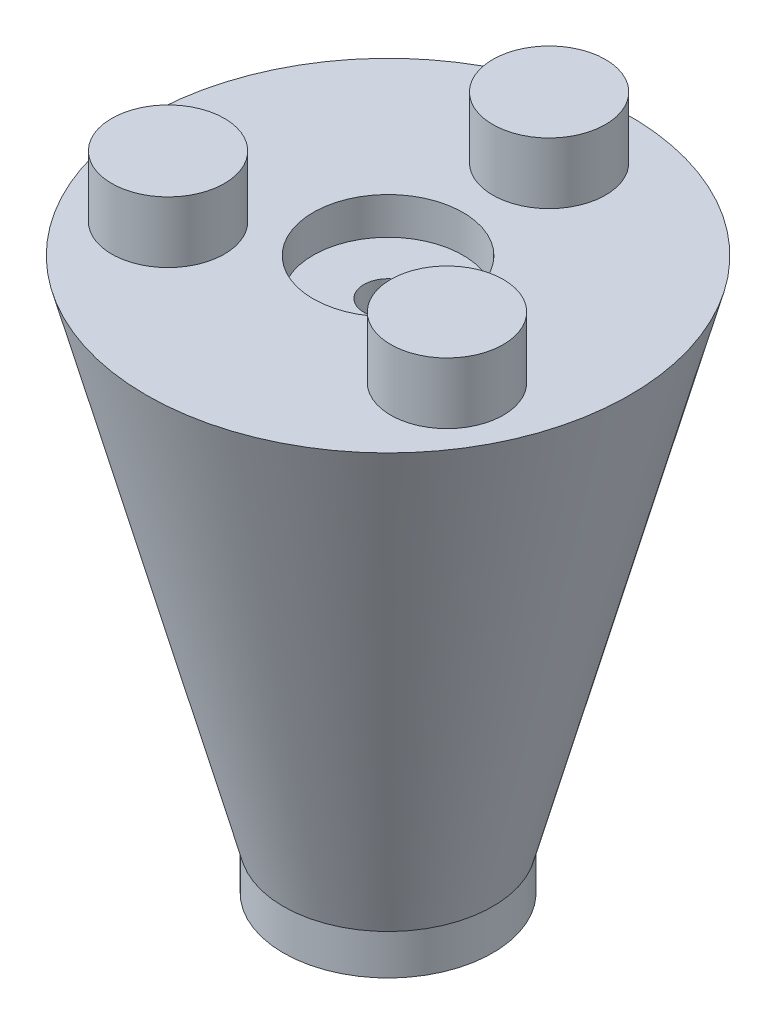
ISO-10303-21;
HEADER;
FILE_DESCRIPTION(('STEP AP214'),'2;1');
FILE_NAME('part.step','',(''),(''),'','','');
FILE_SCHEMA(('AUTOMOTIVE_DESIGN { 1 0 10303 214 1 1 1 1 }'));
ENDSEC;
DATA;
#1=APPLICATION_CONTEXT('core data for automotive mechanical design processes');
#2=APPLICATION_PROTOCOL_DEFINITION('international standard','automotive_design',2000,#1);
#3=PRODUCT_CONTEXT('',#1,'mechanical');
#4=PRODUCT('Part','Part','',(#3));
#5=PRODUCT_RELATED_PRODUCT_CATEGORY('part','',(#4));
#6=PRODUCT_DEFINITION_FORMATION('','',#4);
#7=PRODUCT_DEFINITION_CONTEXT('part definition',#1,'design');
#8=PRODUCT_DEFINITION('design','',#6,#7);
#9=PRODUCT_DEFINITION_SHAPE('','',#8);
#10=(LENGTH_UNIT() NAMED_UNIT(*) SI_UNIT(.MILLI.,.METRE.));
#11=(NAMED_UNIT(*) PLANE_ANGLE_UNIT() SI_UNIT($,.RADIAN.));
#12=(NAMED_UNIT(*) SI_UNIT($,.STERADIAN.) SOLID_ANGLE_UNIT());
#13=UNCERTAINTY_MEASURE_WITH_UNIT(LENGTH_MEASURE(1.E-05),#10,'distance_accuracy_value','');
#14=(GEOMETRIC_REPRESENTATION_CONTEXT(3) GLOBAL_UNCERTAINTY_ASSIGNED_CONTEXT((#13)) GLOBAL_UNIT_ASSIGNED_CONTEXT((#10,
#11,#12)) REPRESENTATION_CONTEXT('',''));
#15=CARTESIAN_POINT('',(0.,0.,0.));
#16=DIRECTION('',(0.,0.,1.));
#17=DIRECTION('',(1.,0.,0.));
#18=AXIS2_PLACEMENT_3D('',#15,#16,#17);
#19=CARTESIAN_POINT('',(0.,-15.6521861280454,0.));
#20=DIRECTION('',(0.,1.,0.));
#21=DIRECTION('',(0.,0.,1.));
#22=AXIS2_PLACEMENT_3D('',#19,#20,#21);
#23=CYLINDRICAL_SURFACE('',#22,4.649999971);
#24=CARTESIAN_POINT('',(0.,5.450000028,0.));
#25=DIRECTION('',(0.,-1.,0.));
#26=DIRECTION('',(0.,0.,-1.));
#27=AXIS2_PLACEMENT_3D('',#24,#25,#26);
#28=CIRCLE('',#27,4.649999971);
#29=CARTESIAN_POINT('',(0.,5.450000028,-4.649999971));
#30=VERTEX_POINT('',#29);
#31=EDGE_CURVE('E48',#30,#30,#28,.T.);
#32=ORIENTED_EDGE('',*,*,#31,.T.);
#33=EDGE_LOOP('',(#32));
#34=FACE_BOUND('',#33,.T.);
#35=CARTESIAN_POINT('',(0.,-2.50000008,0.));
#36=DIRECTION('',(0.,-1.,0.));
#37=DIRECTION('',(0.,0.,-1.));
#38=AXIS2_PLACEMENT_3D('',#35,#36,#37);
#39=CIRCLE('',#38,4.649999971);
#40=CARTESIAN_POINT('',(0.,-2.50000008,-4.649999971));
#41=VERTEX_POINT('',#40);
#42=EDGE_CURVE('E12',#41,#41,#39,.T.);
#43=ORIENTED_EDGE('',*,*,#42,.F.);
#44=EDGE_LOOP('',(#43));
#45=FACE_BOUND('',#44,.T.);
#46=ADVANCED_FACE('F45',(#34,#45),#23,.T.);
#47=CARTESIAN_POINT('',(0.,5.450000028,0.));
#48=DIRECTION('',(0.,-1.,0.));
#49=DIRECTION('',(0.,0.,-1.));
#50=AXIS2_PLACEMENT_3D('',#47,#48,#49);
#51=PLANE('',#50);
#52=ORIENTED_EDGE('',*,*,#31,.F.);
#53=EDGE_LOOP('',(#52));
#54=FACE_BOUND('',#53,.T.);
#55=CARTESIAN_POINT('',(0.,5.450000028,0.));
#56=DIRECTION('',(0.,1.,0.));
#57=DIRECTION('',(0.,0.,1.));
#58=AXIS2_PLACEMENT_3D('',#55,#56,#57);
#59=CIRCLE('',#58,1.5);
#60=CARTESIAN_POINT('',(0.,5.450000028,1.5));
#61=VERTEX_POINT('',#60);
#62=EDGE_CURVE('E57',#61,#61,#59,.T.);
#63=ORIENTED_EDGE('',*,*,#62,.F.);
#64=EDGE_LOOP('',(#63));
#65=FACE_BOUND('',#64,.T.);
#66=ADVANCED_FACE('F68',(#54,#65),#51,.F.);
#67=CARTESIAN_POINT('',(0.,-2.50000008,0.));
#68=DIRECTION('',(0.,-1.,0.));
#69=DIRECTION('',(0.,0.,-1.));
#70=AXIS2_PLACEMENT_3D('',#67,#68,#69);
#71=PLANE('',#70);
#72=CARTESIAN_POINT('',(0.,-2.50000008,0.));
#73=DIRECTION('',(0.,-1.,0.));
#74=DIRECTION('',(0.,0.,-1.));
#75=AXIS2_PLACEMENT_3D('',#72,#73,#74);
#76=CIRCLE('',#75,3.300000004);
#77=CARTESIAN_POINT('',(0.,-2.50000008,-3.300000004));
#78=VERTEX_POINT('',#77);
#79=EDGE_CURVE('E55',#78,#78,#76,.T.);
#80=ORIENTED_EDGE('',*,*,#79,.F.);
#81=EDGE_LOOP('',(#80));
#82=FACE_BOUND('',#81,.T.);
#83=ORIENTED_EDGE('',*,*,#42,.T.);
#84=EDGE_LOOP('',(#83));
#85=FACE_BOUND('',#84,.T.);
#86=ADVANCED_FACE('F66',(#82,#85),#71,.T.);
#87=CARTESIAN_POINT('',(0.,5.450000028,0.));
#88=DIRECTION('',(0.,-1.,0.));
#89=DIRECTION('',(0.,0.,-1.));
#90=AXIS2_PLACEMENT_3D('',#87,#88,#89);
#91=CONICAL_SURFACE('',#90,1.5,0.222660938189136);
#92=ORIENTED_EDGE('',*,*,#79,.T.);
#93=EDGE_LOOP('',(#92));
#94=FACE_BOUND('',#93,.T.);
#95=ORIENTED_EDGE('',*,*,#62,.T.);
#96=EDGE_LOOP('',(#95));
#97=FACE_BOUND('',#96,.T.);
#98=ADVANCED_FACE('F63',(#94,#97),#91,.F.);
#99=CLOSED_SHELL('',(#46,#66,#86,#98));
#100=MANIFOLD_SOLID_BREP('B2',#99);
#101=CARTESIAN_POINT('',(0.,0.,0.));
#102=DIRECTION('',(0.,1.,0.));
#103=DIRECTION('',(0.,0.,1.));
#104=AXIS2_PLACEMENT_3D('',#101,#102,#103);
#105=CYLINDRICAL_SURFACE('',#104,4.649999971);
#106=CARTESIAN_POINT('',(0.,0.,0.));
#107=DIRECTION('',(0.,1.,0.));
#108=DIRECTION('',(0.,0.,1.));
#109=AXIS2_PLACEMENT_3D('',#106,#107,#108);
#110=CIRCLE('',#109,4.649999971);
#111=CARTESIAN_POINT('',(0.,0.,4.649999971));
#112=VERTEX_POINT('',#111);
#113=EDGE_CURVE('E118',#112,#112,#110,.T.);
#114=ORIENTED_EDGE('',*,*,#113,.F.);
#115=EDGE_LOOP('',(#114));
#116=FACE_BOUND('',#115,.T.);
#117=CARTESIAN_POINT('',(0.,5.450000028,0.));
#118=DIRECTION('',(0.,1.,0.));
#119=DIRECTION('',(0.,0.,1.));
#120=AXIS2_PLACEMENT_3D('',#117,#118,#119);
#121=CIRCLE('',#120,4.649999971);
#122=CARTESIAN_POINT('',(0.,5.450000028,4.649999971));
#123=VERTEX_POINT('',#122);
#124=EDGE_CURVE('E44',#123,#123,#121,.F.);
#125=ORIENTED_EDGE('',*,*,#124,.F.);
#126=EDGE_LOOP('',(#125));
#127=FACE_BOUND('',#126,.T.);
#128=ADVANCED_FACE('F107',(#116,#127),#105,.F.);
#129=CARTESIAN_POINT('',(0.,31.75,0.));
#130=DIRECTION('',(0.,1.,0.));
#131=DIRECTION('',(0.,0.,1.));
#132=AXIS2_PLACEMENT_3D('',#129,#130,#131);
#133=PLANE('',#132);
#134=CARTESIAN_POINT('',(-8.66025409500206,31.75,5.000000033));
#135=DIRECTION('',(0.,1.,0.));
#136=DIRECTION('',(0.,0.,1.));
#137=AXIS2_PLACEMENT_3D('',#134,#135,#136);
#138=CIRCLE('',#137,3.499999985);
#139=CARTESIAN_POINT('',(-8.66025409500206,31.75,1.500000048));
#140=VERTEX_POINT('',#139);
#141=EDGE_CURVE('E134',#140,#140,#138,.T.);
#142=ORIENTED_EDGE('',*,*,#141,.F.);
#143=EDGE_LOOP('',(#142));
#144=FACE_BOUND('',#143,.T.);
#145=CARTESIAN_POINT('',(0.,31.75,0.));
#146=DIRECTION('',(0.,1.,0.));
#147=DIRECTION('',(0.,0.,1.));
#148=AXIS2_PLACEMENT_3D('',#145,#146,#147);
#149=CIRCLE('',#148,15.0073869406882);
#150=CARTESIAN_POINT('',(0.,31.75,15.0073869406882));
#151=VERTEX_POINT('',#150);
#152=EDGE_CURVE('E114',#151,#151,#149,.T.);
#153=ORIENTED_EDGE('',*,*,#152,.T.);
#154=EDGE_LOOP('',(#153));
#155=FACE_BOUND('',#154,.T.);
#156=CARTESIAN_POINT('',(0.,31.75,0.));
#157=DIRECTION('',(0.,1.,0.));
#158=DIRECTION('',(0.,0.,1.));
#159=AXIS2_PLACEMENT_3D('',#156,#157,#158);
#160=CIRCLE('',#159,4.649999971);
#161=CARTESIAN_POINT('',(0.,31.75,4.649999971));
#162=VERTEX_POINT('',#161);
#163=EDGE_CURVE('E122',#162,#162,#160,.T.);
#164=ORIENTED_EDGE('',*,*,#163,.F.);
#165=EDGE_LOOP('',(#164));
#166=FACE_BOUND('',#165,.T.);
#167=CARTESIAN_POINT('',(0.,31.75,-10.000000066));
#168=DIRECTION('',(0.,1.,0.));
#169=DIRECTION('',(0.,0.,1.));
#170=AXIS2_PLACEMENT_3D('',#167,#168,#169);
#171=CIRCLE('',#170,3.499999985);
#172=CARTESIAN_POINT('',(0.,31.75,-13.500000051));
#173=VERTEX_POINT('',#172);
#174=EDGE_CURVE('E128',#173,#173,#171,.T.);
#175=ORIENTED_EDGE('',*,*,#174,.F.);
#176=EDGE_LOOP('',(#175));
#177=FACE_BOUND('',#176,.T.);
#178=CARTESIAN_POINT('',(8.66025409500207,31.75,5.000000033));
#179=DIRECTION('',(0.,1.,0.));
#180=DIRECTION('',(0.,0.,1.));
#181=AXIS2_PLACEMENT_3D('',#178,#179,#180);
#182=CIRCLE('',#181,3.499999985);
#183=CARTESIAN_POINT('',(8.66025409500207,31.75,1.500000048));
#184=VERTEX_POINT('',#183);
#185=EDGE_CURVE('E140',#184,#184,#182,.T.);
#186=ORIENTED_EDGE('',*,*,#185,.F.);
#187=EDGE_LOOP('',(#186));
#188=FACE_BOUND('',#187,.T.);
#189=ADVANCED_FACE('F188',(#144,#155,#166,#177,#188),#133,.T.);
#190=CARTESIAN_POINT('',(0.,0.,0.));
#191=DIRECTION('',(0.,1.,0.));
#192=DIRECTION('',(0.,0.,1.));
#193=AXIS2_PLACEMENT_3D('',#190,#191,#192);
#194=CONICAL_SURFACE('',#193,6.500000081,0.26179938779915);
#195=ORIENTED_EDGE('',*,*,#152,.F.);
#196=EDGE_LOOP('',(#195));
#197=FACE_BOUND('',#196,.T.);
#198=CARTESIAN_POINT('',(0.,0.,0.));
#199=DIRECTION('',(0.,-1.,0.));
#200=DIRECTION('',(0.,0.,-1.));
#201=AXIS2_PLACEMENT_3D('',#198,#199,#200);
#202=CIRCLE('',#201,6.500000081);
#203=CARTESIAN_POINT('',(0.,0.,-6.500000081));
#204=VERTEX_POINT('',#203);
#205=EDGE_CURVE('E146',#204,#204,#202,.T.);
#206=ORIENTED_EDGE('',*,*,#205,.F.);
#207=EDGE_LOOP('',(#206));
#208=FACE_BOUND('',#207,.T.);
#209=ADVANCED_FACE('F109',(#197,#208),#194,.T.);
#210=CARTESIAN_POINT('',(0.,29.450000028,0.));
#211=DIRECTION('',(0.,1.,0.));
#212=DIRECTION('',(0.,0.,1.));
#213=AXIS2_PLACEMENT_3D('',#210,#211,#212);
#214=CIRCLE('',#213,4.649999971);
#215=CARTESIAN_POINT('',(0.,29.450000028,4.649999971));
#216=VERTEX_POINT('',#215);
#217=EDGE_CURVE('E155',#216,#216,#214,.T.);
#218=ORIENTED_EDGE('',*,*,#217,.F.);
#219=EDGE_LOOP('',(#218));
#220=FACE_BOUND('',#219,.T.);
#221=ORIENTED_EDGE('',*,*,#163,.T.);
#222=EDGE_LOOP('',(#221));
#223=FACE_BOUND('',#222,.T.);
#224=ADVANCED_FACE('F181',(#220,#223),#105,.F.);
#225=CARTESIAN_POINT('',(0.,35.55000002,-10.000000066));
#226=DIRECTION('',(0.,-1.,0.));
#227=DIRECTION('',(0.,0.,-1.));
#228=AXIS2_PLACEMENT_3D('',#225,#226,#227);
#229=CYLINDRICAL_SURFACE('',#228,3.499999985);
#230=CARTESIAN_POINT('',(0.,35.55000002,-10.000000066));
#231=DIRECTION('',(0.,1.,0.));
#232=DIRECTION('',(0.,0.,1.));
#233=AXIS2_PLACEMENT_3D('',#230,#231,#232);
#234=CIRCLE('',#233,3.499999985);
#235=CARTESIAN_POINT('',(0.,35.55000002,-13.500000051));
#236=VERTEX_POINT('',#235);
#237=EDGE_CURVE('E126',#236,#236,#234,.T.);
#238=CARTESIAN_POINT('',(0.,35.55000002,-13.500000051));
#239=CARTESIAN_POINT('',(0.,35.5104166864583,-13.500000051));
#240=CARTESIAN_POINT('',(0.,35.4708333529167,-13.500000051));
#241=CARTESIAN_POINT('',(0.,35.3916666858333,-13.500000051));
#242=CARTESIAN_POINT('',(0.,35.3520833522917,-13.500000051));
#243=CARTESIAN_POINT('',(0.,35.2729166852083,-13.500000051));
#244=CARTESIAN_POINT('',(0.,35.2333333516667,-13.500000051));
#245=CARTESIAN_POINT('',(0.,35.1541666845833,-13.500000051));
#246=CARTESIAN_POINT('',(0.,35.1145833510417,-13.500000051));
#247=CARTESIAN_POINT('',(0.,35.0354166839583,-13.500000051));
#248=CARTESIAN_POINT('',(0.,34.9958333504167,-13.500000051));
#249=CARTESIAN_POINT('',(0.,34.9166666833333,-13.500000051));
#250=CARTESIAN_POINT('',(0.,34.8770833497917,-13.500000051));
#251=CARTESIAN_POINT('',(0.,34.7979166827083,-13.500000051));
#252=CARTESIAN_POINT('',(0.,34.7583333491667,-13.500000051));
#253=CARTESIAN_POINT('',(0.,34.6791666820833,-13.500000051));
#254=CARTESIAN_POINT('',(0.,34.6395833485417,-13.500000051));
#255=CARTESIAN_POINT('',(0.,34.5604166814583,-13.500000051));
#256=CARTESIAN_POINT('',(0.,34.5208333479167,-13.500000051));
#257=CARTESIAN_POINT('',(0.,34.4416666808333,-13.500000051));
#258=CARTESIAN_POINT('',(0.,34.4020833472917,-13.500000051));
#259=CARTESIAN_POINT('',(0.,34.3229166802083,-13.500000051));
#260=CARTESIAN_POINT('',(0.,34.2833333466667,-13.500000051));
#261=CARTESIAN_POINT('',(0.,34.2041666795833,-13.500000051));
#262=CARTESIAN_POINT('',(0.,34.1645833460417,-13.500000051));
#263=CARTESIAN_POINT('',(0.,34.0854166789583,-13.500000051));
#264=CARTESIAN_POINT('',(0.,34.0458333454167,-13.500000051));
#265=CARTESIAN_POINT('',(0.,33.9666666783333,-13.500000051));
#266=CARTESIAN_POINT('',(0.,33.9270833447917,-13.500000051));
#267=CARTESIAN_POINT('',(0.,33.8479166777083,-13.500000051));
#268=CARTESIAN_POINT('',(0.,33.8083333441667,-13.500000051));
#269=CARTESIAN_POINT('',(0.,33.7291666770833,-13.500000051));
#270=CARTESIAN_POINT('',(0.,33.6895833435417,-13.500000051));
#271=CARTESIAN_POINT('',(0.,33.6104166764583,-13.500000051));
#272=CARTESIAN_POINT('',(0.,33.5708333429167,-13.500000051));
#273=CARTESIAN_POINT('',(0.,33.4916666758333,-13.500000051));
#274=CARTESIAN_POINT('',(0.,33.4520833422917,-13.500000051));
#275=CARTESIAN_POINT('',(0.,33.3729166752083,-13.500000051));
#276=CARTESIAN_POINT('',(0.,33.3333333416667,-13.500000051));
#277=CARTESIAN_POINT('',(0.,33.2541666745833,-13.500000051));
#278=CARTESIAN_POINT('',(0.,33.2145833410417,-13.500000051));
#279=CARTESIAN_POINT('',(0.,33.1354166739583,-13.500000051));
#280=CARTESIAN_POINT('',(0.,33.0958333404167,-13.500000051));
#281=CARTESIAN_POINT('',(0.,33.0166666733333,-13.500000051));
#282=CARTESIAN_POINT('',(0.,32.9770833397917,-13.500000051));
#283=CARTESIAN_POINT('',(0.,32.8979166727083,-13.500000051));
#284=CARTESIAN_POINT('',(0.,32.8583333391667,-13.500000051));
#285=CARTESIAN_POINT('',(0.,32.7791666720833,-13.500000051));
#286=CARTESIAN_POINT('',(0.,32.7395833385417,-13.500000051));
#287=CARTESIAN_POINT('',(0.,32.6604166714583,-13.500000051));
#288=CARTESIAN_POINT('',(0.,32.6208333379167,-13.500000051));
#289=CARTESIAN_POINT('',(0.,32.5416666708333,-13.500000051));
#290=CARTESIAN_POINT('',(0.,32.5020833372917,-13.500000051));
#291=CARTESIAN_POINT('',(0.,32.4229166702083,-13.500000051));
#292=CARTESIAN_POINT('',(0.,32.3833333366667,-13.500000051));
#293=CARTESIAN_POINT('',(0.,32.3041666695833,-13.500000051));
#294=CARTESIAN_POINT('',(0.,32.2645833360417,-13.500000051));
#295=CARTESIAN_POINT('',(0.,32.1854166689583,-13.500000051));
#296=CARTESIAN_POINT('',(0.,32.1458333354167,-13.500000051));
#297=CARTESIAN_POINT('',(0.,32.0666666683333,-13.500000051));
#298=CARTESIAN_POINT('',(0.,32.0270833347917,-13.500000051));
#299=CARTESIAN_POINT('',(0.,31.9479166677083,-13.500000051));
#300=CARTESIAN_POINT('',(0.,31.9083333341667,-13.500000051));
#301=CARTESIAN_POINT('',(0.,31.8291666670833,-13.500000051));
#302=CARTESIAN_POINT('',(0.,31.7895833335417,-13.500000051));
#303=CARTESIAN_POINT('',(0.,31.75,-13.500000051));
#304=B_SPLINE_CURVE_WITH_KNOTS('',3,(#238,#239,#240,#241,#242,#243,#244,#245,#246,#247,#248,
#249,#250,#251,#252,#253,#254,#255,#256,#257,#258,#259,#260,#261,#262,#263,#264,#265,#266,#267,
#268,#269,#270,#271,#272,#273,#274,#275,#276,#277,#278,#279,#280,#281,#282,#283,#284,#285,#286,
#287,#288,#289,#290,#291,#292,#293,#294,#295,#296,#297,#298,#299,#300,#301,#302,#303),
.UNSPECIFIED.,.F.,.F.,(4,2,2,2,2,2,2,2,2,2,2,2,2,2,2,2,2,2,2,2,2,2,2,2,2,2,2,2,2,2,2,2,4),(0.,
0.118750000624994,0.237500001249995,0.356250001874996,0.475000002499996,0.593750003124997,
0.712500003749998,0.831250004374999,0.950000005,1.06875000562499,1.18750000624999,
1.306250006875,1.4250000075,1.543750008125,1.66250000875,1.781250009375,1.90000001,
2.01875001062499,2.13750001124999,2.256250011875,2.3750000125,2.493750013125,2.61250001375,
2.731250014375,2.850000015,2.96875001562499,3.08750001624999,3.206250016875,3.3250000175,
3.443750018125,3.56250001875,3.681250019375,3.80000002),.UNSPECIFIED.);
#305=EDGE_CURVE('BSEAM184',#236,#173,#304,.T.);
#306=ORIENTED_EDGE('',*,*,#237,.F.);
#307=ORIENTED_EDGE('',*,*,#174,.T.);
#308=ORIENTED_EDGE('',*,*,#305,.T.);
#309=ORIENTED_EDGE('',*,*,#305,.F.);
#310=EDGE_LOOP('',(#306,#308,#307,#309));
#311=FACE_BOUND('',#310,.T.);
#312=ADVANCED_FACE('F184',(#311),#229,.T.);
#313=CARTESIAN_POINT('',(0.,35.55000002,0.));
#314=DIRECTION('',(0.,1.,0.));
#315=DIRECTION('',(0.,0.,1.));
#316=AXIS2_PLACEMENT_3D('',#313,#314,#315);
#317=PLANE('',#316);
#318=ORIENTED_EDGE('',*,*,#237,.T.);
#319=EDGE_LOOP('',(#318));
#320=FACE_BOUND('',#319,.T.);
#321=ADVANCED_FACE('F223',(#320),#317,.T.);
#322=CARTESIAN_POINT('',(-8.66025409500206,35.55000002,5.000000033));
#323=DIRECTION('',(0.,-1.,0.));
#324=DIRECTION('',(0.,0.,-1.));
#325=AXIS2_PLACEMENT_3D('',#322,#323,#324);
#326=CYLINDRICAL_SURFACE('',#325,3.499999985);
#327=CARTESIAN_POINT('',(-8.66025409500206,35.55000002,5.000000033));
#328=DIRECTION('',(0.,1.,0.));
#329=DIRECTION('',(0.,0.,1.));
#330=AXIS2_PLACEMENT_3D('',#327,#328,#329);
#331=CIRCLE('',#330,3.499999985);
#332=CARTESIAN_POINT('',(-8.66025409500206,35.55000002,1.500000048));
#333=VERTEX_POINT('',#332);
#334=EDGE_CURVE('E131',#333,#333,#331,.T.);
#335=CARTESIAN_POINT('',(-8.66025409500206,35.55000002,1.500000048));
#336=CARTESIAN_POINT('',(-8.66025409500206,35.5104166864583,1.500000048));
#337=CARTESIAN_POINT('',(-8.66025409500206,35.4708333529167,1.500000048));
#338=CARTESIAN_POINT('',(-8.66025409500206,35.3916666858333,1.500000048));
#339=CARTESIAN_POINT('',(-8.66025409500206,35.3520833522917,1.500000048));
#340=CARTESIAN_POINT('',(-8.66025409500206,35.2729166852083,1.500000048));
#341=CARTESIAN_POINT('',(-8.66025409500206,35.2333333516667,1.500000048));
#342=CARTESIAN_POINT('',(-8.66025409500206,35.1541666845833,1.500000048));
#343=CARTESIAN_POINT('',(-8.66025409500206,35.1145833510417,1.500000048));
#344=CARTESIAN_POINT('',(-8.66025409500206,35.0354166839583,1.500000048));
#345=CARTESIAN_POINT('',(-8.66025409500206,34.9958333504167,1.500000048));
#346=CARTESIAN_POINT('',(-8.66025409500206,34.9166666833333,1.500000048));
#347=CARTESIAN_POINT('',(-8.66025409500206,34.8770833497917,1.500000048));
#348=CARTESIAN_POINT('',(-8.66025409500206,34.7979166827083,1.500000048));
#349=CARTESIAN_POINT('',(-8.66025409500206,34.7583333491667,1.500000048));
#350=CARTESIAN_POINT('',(-8.66025409500206,34.6791666820833,1.500000048));
#351=CARTESIAN_POINT('',(-8.66025409500206,34.6395833485417,1.500000048));
#352=CARTESIAN_POINT('',(-8.66025409500206,34.5604166814583,1.500000048));
#353=CARTESIAN_POINT('',(-8.66025409500206,34.5208333479167,1.500000048));
#354=CARTESIAN_POINT('',(-8.66025409500206,34.4416666808333,1.500000048));
#355=CARTESIAN_POINT('',(-8.66025409500206,34.4020833472917,1.500000048));
#356=CARTESIAN_POINT('',(-8.66025409500206,34.3229166802083,1.500000048));
#357=CARTESIAN_POINT('',(-8.66025409500206,34.2833333466667,1.500000048));
#358=CARTESIAN_POINT('',(-8.66025409500206,34.2041666795833,1.500000048));
#359=CARTESIAN_POINT('',(-8.66025409500206,34.1645833460417,1.500000048));
#360=CARTESIAN_POINT('',(-8.66025409500206,34.0854166789583,1.500000048));
#361=CARTESIAN_POINT('',(-8.66025409500206,34.0458333454167,1.500000048));
#362=CARTESIAN_POINT('',(-8.66025409500206,33.9666666783333,1.500000048));
#363=CARTESIAN_POINT('',(-8.66025409500206,33.9270833447917,1.500000048));
#364=CARTESIAN_POINT('',(-8.66025409500206,33.8479166777083,1.500000048));
#365=CARTESIAN_POINT('',(-8.66025409500206,33.8083333441667,1.500000048));
#366=CARTESIAN_POINT('',(-8.66025409500206,33.7291666770833,1.500000048));
#367=CARTESIAN_POINT('',(-8.66025409500206,33.6895833435417,1.500000048));
#368=CARTESIAN_POINT('',(-8.66025409500206,33.6104166764583,1.500000048));
#369=CARTESIAN_POINT('',(-8.66025409500206,33.5708333429167,1.500000048));
#370=CARTESIAN_POINT('',(-8.66025409500206,33.4916666758333,1.500000048));
#371=CARTESIAN_POINT('',(-8.66025409500206,33.4520833422917,1.500000048));
#372=CARTESIAN_POINT('',(-8.66025409500206,33.3729166752083,1.500000048));
#373=CARTESIAN_POINT('',(-8.66025409500206,33.3333333416667,1.500000048));
#374=CARTESIAN_POINT('',(-8.66025409500206,33.2541666745833,1.500000048));
#375=CARTESIAN_POINT('',(-8.66025409500206,33.2145833410417,1.500000048));
#376=CARTESIAN_POINT('',(-8.66025409500206,33.1354166739583,1.500000048));
#377=CARTESIAN_POINT('',(-8.66025409500206,33.0958333404167,1.500000048));
#378=CARTESIAN_POINT('',(-8.66025409500206,33.0166666733333,1.500000048));
#379=CARTESIAN_POINT('',(-8.66025409500206,32.9770833397917,1.500000048));
#380=CARTESIAN_POINT('',(-8.66025409500206,32.8979166727083,1.500000048));
#381=CARTESIAN_POINT('',(-8.66025409500206,32.8583333391667,1.500000048));
#382=CARTESIAN_POINT('',(-8.66025409500206,32.7791666720833,1.500000048));
#383=CARTESIAN_POINT('',(-8.66025409500206,32.7395833385417,1.500000048));
#384=CARTESIAN_POINT('',(-8.66025409500206,32.6604166714583,1.500000048));
#385=CARTESIAN_POINT('',(-8.66025409500206,32.6208333379167,1.500000048));
#386=CARTESIAN_POINT('',(-8.66025409500206,32.5416666708333,1.500000048));
#387=CARTESIAN_POINT('',(-8.66025409500206,32.5020833372917,1.500000048));
#388=CARTESIAN_POINT('',(-8.66025409500206,32.4229166702083,1.500000048));
#389=CARTESIAN_POINT('',(-8.66025409500206,32.3833333366667,1.500000048));
#390=CARTESIAN_POINT('',(-8.66025409500206,32.3041666695833,1.500000048));
#391=CARTESIAN_POINT('',(-8.66025409500206,32.2645833360417,1.500000048));
#392=CARTESIAN_POINT('',(-8.66025409500206,32.1854166689583,1.500000048));
#393=CARTESIAN_POINT('',(-8.66025409500206,32.1458333354167,1.500000048));
#394=CARTESIAN_POINT('',(-8.66025409500206,32.0666666683333,1.500000048));
#395=CARTESIAN_POINT('',(-8.66025409500206,32.0270833347917,1.500000048));
#396=CARTESIAN_POINT('',(-8.66025409500206,31.9479166677083,1.500000048));
#397=CARTESIAN_POINT('',(-8.66025409500206,31.9083333341667,1.500000048));
#398=CARTESIAN_POINT('',(-8.66025409500206,31.8291666670833,1.500000048));
#399=CARTESIAN_POINT('',(-8.66025409500206,31.7895833335417,1.500000048));
#400=CARTESIAN_POINT('',(-8.66025409500206,31.75,1.500000048));
#401=B_SPLINE_CURVE_WITH_KNOTS('',3,(#335,#336,#337,#338,#339,#340,#341,#342,#343,#344,#345,
#346,#347,#348,#349,#350,#351,#352,#353,#354,#355,#356,#357,#358,#359,#360,#361,#362,#363,#364,
#365,#366,#367,#368,#369,#370,#371,#372,#373,#374,#375,#376,#377,#378,#379,#380,#381,#382,#383,
#384,#385,#386,#387,#388,#389,#390,#391,#392,#393,#394,#395,#396,#397,#398,#399,#400),
.UNSPECIFIED.,.F.,.F.,(4,2,2,2,2,2,2,2,2,2,2,2,2,2,2,2,2,2,2,2,2,2,2,2,2,2,2,2,2,2,2,2,4),(0.,
0.118750000624994,0.237500001249995,0.356250001874996,0.475000002499996,0.593750003124997,
0.712500003749998,0.831250004374999,0.950000005,1.06875000562499,1.18750000624999,
1.306250006875,1.4250000075,1.543750008125,1.66250000875,1.781250009375,1.90000001,
2.01875001062499,2.13750001124999,2.256250011875,2.3750000125,2.493750013125,2.61250001375,
2.731250014375,2.850000015,2.96875001562499,3.08750001624999,3.206250016875,3.3250000175,
3.443750018125,3.56250001875,3.681250019375,3.80000002),.UNSPECIFIED.);
#402=EDGE_CURVE('BSEAM209',#333,#140,#401,.T.);
#403=ORIENTED_EDGE('',*,*,#334,.F.);
#404=ORIENTED_EDGE('',*,*,#141,.T.);
#405=ORIENTED_EDGE('',*,*,#402,.T.);
#406=ORIENTED_EDGE('',*,*,#402,.F.);
#407=EDGE_LOOP('',(#403,#405,#404,#406));
#408=FACE_BOUND('',#407,.T.);
#409=ADVANCED_FACE('F209',(#408),#326,.T.);
#410=CARTESIAN_POINT('',(0.,35.55000002,0.));
#411=DIRECTION('',(0.,1.,0.));
#412=DIRECTION('',(0.,0.,1.));
#413=AXIS2_PLACEMENT_3D('',#410,#411,#412);
#414=PLANE('',#413);
#415=ORIENTED_EDGE('',*,*,#334,.T.);
#416=EDGE_LOOP('',(#415));
#417=FACE_BOUND('',#416,.T.);
#418=ADVANCED_FACE('F199',(#417),#414,.T.);
#419=CARTESIAN_POINT('',(8.66025409500207,35.55000002,5.000000033));
#420=DIRECTION('',(0.,-1.,0.));
#421=DIRECTION('',(0.,0.,-1.));
#422=AXIS2_PLACEMENT_3D('',#419,#420,#421);
#423=CYLINDRICAL_SURFACE('',#422,3.499999985);
#424=CARTESIAN_POINT('',(8.66025409500207,35.55000002,5.000000033));
#425=DIRECTION('',(0.,1.,0.));
#426=DIRECTION('',(0.,0.,1.));
#427=AXIS2_PLACEMENT_3D('',#424,#425,#426);
#428=CIRCLE('',#427,3.499999985);
#429=CARTESIAN_POINT('',(8.66025409500207,35.55000002,1.500000048));
#430=VERTEX_POINT('',#429);
#431=EDGE_CURVE('E137',#430,#430,#428,.T.);
#432=CARTESIAN_POINT('',(8.66025409500207,35.55000002,1.500000048));
#433=CARTESIAN_POINT('',(8.66025409500207,35.5104166864583,1.500000048));
#434=CARTESIAN_POINT('',(8.66025409500207,35.4708333529167,1.500000048));
#435=CARTESIAN_POINT('',(8.66025409500207,35.3916666858333,1.500000048));
#436=CARTESIAN_POINT('',(8.66025409500207,35.3520833522917,1.500000048));
#437=CARTESIAN_POINT('',(8.66025409500207,35.2729166852083,1.500000048));
#438=CARTESIAN_POINT('',(8.66025409500207,35.2333333516667,1.500000048));
#439=CARTESIAN_POINT('',(8.66025409500207,35.1541666845833,1.500000048));
#440=CARTESIAN_POINT('',(8.66025409500207,35.1145833510417,1.500000048));
#441=CARTESIAN_POINT('',(8.66025409500207,35.0354166839583,1.500000048));
#442=CARTESIAN_POINT('',(8.66025409500207,34.9958333504167,1.500000048));
#443=CARTESIAN_POINT('',(8.66025409500207,34.9166666833333,1.500000048));
#444=CARTESIAN_POINT('',(8.66025409500207,34.8770833497917,1.500000048));
#445=CARTESIAN_POINT('',(8.66025409500207,34.7979166827083,1.500000048));
#446=CARTESIAN_POINT('',(8.66025409500207,34.7583333491667,1.500000048));
#447=CARTESIAN_POINT('',(8.66025409500207,34.6791666820833,1.500000048));
#448=CARTESIAN_POINT('',(8.66025409500207,34.6395833485417,1.500000048));
#449=CARTESIAN_POINT('',(8.66025409500207,34.5604166814583,1.500000048));
#450=CARTESIAN_POINT('',(8.66025409500207,34.5208333479167,1.500000048));
#451=CARTESIAN_POINT('',(8.66025409500207,34.4416666808333,1.500000048));
#452=CARTESIAN_POINT('',(8.66025409500207,34.4020833472917,1.500000048));
#453=CARTESIAN_POINT('',(8.66025409500207,34.3229166802083,1.500000048));
#454=CARTESIAN_POINT('',(8.66025409500207,34.2833333466667,1.500000048));
#455=CARTESIAN_POINT('',(8.66025409500207,34.2041666795833,1.500000048));
#456=CARTESIAN_POINT('',(8.66025409500207,34.1645833460417,1.500000048));
#457=CARTESIAN_POINT('',(8.66025409500207,34.0854166789583,1.500000048));
#458=CARTESIAN_POINT('',(8.66025409500207,34.0458333454167,1.500000048));
#459=CARTESIAN_POINT('',(8.66025409500207,33.9666666783333,1.500000048));
#460=CARTESIAN_POINT('',(8.66025409500207,33.9270833447917,1.500000048));
#461=CARTESIAN_POINT('',(8.66025409500207,33.8479166777083,1.500000048));
#462=CARTESIAN_POINT('',(8.66025409500207,33.8083333441667,1.500000048));
#463=CARTESIAN_POINT('',(8.66025409500207,33.7291666770833,1.500000048));
#464=CARTESIAN_POINT('',(8.66025409500207,33.6895833435417,1.500000048));
#465=CARTESIAN_POINT('',(8.66025409500207,33.6104166764583,1.500000048));
#466=CARTESIAN_POINT('',(8.66025409500207,33.5708333429167,1.500000048));
#467=CARTESIAN_POINT('',(8.66025409500207,33.4916666758333,1.500000048));
#468=CARTESIAN_POINT('',(8.66025409500207,33.4520833422917,1.500000048));
#469=CARTESIAN_POINT('',(8.66025409500207,33.3729166752083,1.500000048));
#470=CARTESIAN_POINT('',(8.66025409500207,33.3333333416667,1.500000048));
#471=CARTESIAN_POINT('',(8.66025409500207,33.2541666745833,1.500000048));
#472=CARTESIAN_POINT('',(8.66025409500207,33.2145833410417,1.500000048));
#473=CARTESIAN_POINT('',(8.66025409500207,33.1354166739583,1.500000048));
#474=CARTESIAN_POINT('',(8.66025409500207,33.0958333404167,1.500000048));
#475=CARTESIAN_POINT('',(8.66025409500207,33.0166666733333,1.500000048));
#476=CARTESIAN_POINT('',(8.66025409500207,32.9770833397917,1.500000048));
#477=CARTESIAN_POINT('',(8.66025409500207,32.8979166727083,1.500000048));
#478=CARTESIAN_POINT('',(8.66025409500207,32.8583333391667,1.500000048));
#479=CARTESIAN_POINT('',(8.66025409500207,32.7791666720833,1.500000048));
#480=CARTESIAN_POINT('',(8.66025409500207,32.7395833385417,1.500000048));
#481=CARTESIAN_POINT('',(8.66025409500207,32.6604166714583,1.500000048));
#482=CARTESIAN_POINT('',(8.66025409500207,32.6208333379167,1.500000048));
#483=CARTESIAN_POINT('',(8.66025409500207,32.5416666708333,1.500000048));
#484=CARTESIAN_POINT('',(8.66025409500207,32.5020833372917,1.500000048));
#485=CARTESIAN_POINT('',(8.66025409500207,32.4229166702083,1.500000048));
#486=CARTESIAN_POINT('',(8.66025409500207,32.3833333366667,1.500000048));
#487=CARTESIAN_POINT('',(8.66025409500207,32.3041666695833,1.500000048));
#488=CARTESIAN_POINT('',(8.66025409500207,32.2645833360417,1.500000048));
#489=CARTESIAN_POINT('',(8.66025409500207,32.1854166689583,1.500000048));
#490=CARTESIAN_POINT('',(8.66025409500207,32.1458333354167,1.500000048));
#491=CARTESIAN_POINT('',(8.66025409500207,32.0666666683333,1.500000048));
#492=CARTESIAN_POINT('',(8.66025409500207,32.0270833347917,1.500000048));
#493=CARTESIAN_POINT('',(8.66025409500207,31.9479166677083,1.500000048));
#494=CARTESIAN_POINT('',(8.66025409500207,31.9083333341667,1.500000048));
#495=CARTESIAN_POINT('',(8.66025409500207,31.8291666670833,1.500000048));
#496=CARTESIAN_POINT('',(8.66025409500207,31.7895833335417,1.500000048));
#497=CARTESIAN_POINT('',(8.66025409500207,31.75,1.500000048));
#498=B_SPLINE_CURVE_WITH_KNOTS('',3,(#432,#433,#434,#435,#436,#437,#438,#439,#440,#441,#442,
#443,#444,#445,#446,#447,#448,#449,#450,#451,#452,#453,#454,#455,#456,#457,#458,#459,#460,#461,
#462,#463,#464,#465,#466,#467,#468,#469,#470,#471,#472,#473,#474,#475,#476,#477,#478,#479,#480,
#481,#482,#483,#484,#485,#486,#487,#488,#489,#490,#491,#492,#493,#494,#495,#496,#497),
.UNSPECIFIED.,.F.,.F.,(4,2,2,2,2,2,2,2,2,2,2,2,2,2,2,2,2,2,2,2,2,2,2,2,2,2,2,2,2,2,2,2,4),(0.,
0.118750000624994,0.237500001249995,0.356250001874996,0.475000002499996,0.593750003124997,
0.712500003749998,0.831250004374999,0.950000005,1.06875000562499,1.18750000624999,
1.306250006875,1.4250000075,1.543750008125,1.66250000875,1.781250009375,1.90000001,
2.01875001062499,2.13750001124999,2.256250011875,2.3750000125,2.493750013125,2.61250001375,
2.731250014375,2.850000015,2.96875001562499,3.08750001624999,3.206250016875,3.3250000175,
3.443750018125,3.56250001875,3.681250019375,3.80000002),.UNSPECIFIED.);
#499=EDGE_CURVE('BSEAM196',#430,#184,#498,.T.);
#500=ORIENTED_EDGE('',*,*,#431,.F.);
#501=ORIENTED_EDGE('',*,*,#185,.T.);
#502=ORIENTED_EDGE('',*,*,#499,.T.);
#503=ORIENTED_EDGE('',*,*,#499,.F.);
#504=EDGE_LOOP('',(#500,#502,#501,#503));
#505=FACE_BOUND('',#504,.T.);
#506=ADVANCED_FACE('F196',(#505),#423,.T.);
#507=CARTESIAN_POINT('',(0.,35.55000002,0.));
#508=DIRECTION('',(0.,1.,0.));
#509=DIRECTION('',(0.,0.,1.));
#510=AXIS2_PLACEMENT_3D('',#507,#508,#509);
#511=PLANE('',#510);
#512=ORIENTED_EDGE('',*,*,#431,.T.);
#513=EDGE_LOOP('',(#512));
#514=FACE_BOUND('',#513,.T.);
#515=ADVANCED_FACE('F198',(#514),#511,.T.);
#516=CARTESIAN_POINT('',(0.,0.,0.));
#517=DIRECTION('',(0.,-1.,0.));
#518=DIRECTION('',(0.,0.,-1.));
#519=AXIS2_PLACEMENT_3D('',#516,#517,#518);
#520=PLANE('',#519);
#521=CARTESIAN_POINT('',(0.,0.,0.));
#522=DIRECTION('',(0.,-1.,0.));
#523=DIRECTION('',(0.,0.,-1.));
#524=AXIS2_PLACEMENT_3D('',#521,#522,#523);
#525=CIRCLE('',#524,3.300000004);
#526=CARTESIAN_POINT('',(0.,0.,-3.300000004));
#527=VERTEX_POINT('',#526);
#528=EDGE_CURVE('E152',#527,#527,#525,.T.);
#529=ORIENTED_EDGE('',*,*,#528,.T.);
#530=EDGE_LOOP('',(#529));
#531=FACE_BOUND('',#530,.T.);
#532=ORIENTED_EDGE('',*,*,#113,.T.);
#533=EDGE_LOOP('',(#532));
#534=FACE_BOUND('',#533,.T.);
#535=ADVANCED_FACE('F206',(#531,#534),#520,.F.);
#536=CARTESIAN_POINT('',(0.,-2.50000008,0.));
#537=DIRECTION('',(0.,-1.,0.));
#538=DIRECTION('',(0.,0.,-1.));
#539=AXIS2_PLACEMENT_3D('',#536,#537,#538);
#540=PLANE('',#539);
#541=CARTESIAN_POINT('',(0.,-2.50000008,0.));
#542=DIRECTION('',(0.,-1.,0.));
#543=DIRECTION('',(0.,0.,-1.));
#544=AXIS2_PLACEMENT_3D('',#541,#542,#543);
#545=CIRCLE('',#544,6.500000081);
#546=CARTESIAN_POINT('',(0.,-2.50000008,-6.500000081));
#547=VERTEX_POINT('',#546);
#548=EDGE_CURVE('E143',#547,#547,#545,.T.);
#549=ORIENTED_EDGE('',*,*,#548,.T.);
#550=EDGE_LOOP('',(#549));
#551=FACE_BOUND('',#550,.T.);
#552=CARTESIAN_POINT('',(0.,-2.50000008,0.));
#553=DIRECTION('',(0.,-1.,0.));
#554=DIRECTION('',(0.,0.,-1.));
#555=AXIS2_PLACEMENT_3D('',#552,#553,#554);
#556=CIRCLE('',#555,3.300000004);
#557=CARTESIAN_POINT('',(0.,-2.50000008,-3.300000004));
#558=VERTEX_POINT('',#557);
#559=EDGE_CURVE('E149',#558,#558,#556,.T.);
#560=ORIENTED_EDGE('',*,*,#559,.F.);
#561=EDGE_LOOP('',(#560));
#562=FACE_BOUND('',#561,.T.);
#563=ADVANCED_FACE('F262',(#551,#562),#540,.T.);
#564=CARTESIAN_POINT('',(0.,-2.50000008,0.));
#565=DIRECTION('',(0.,1.,0.));
#566=DIRECTION('',(0.,0.,1.));
#567=AXIS2_PLACEMENT_3D('',#564,#565,#566);
#568=CYLINDRICAL_SURFACE('',#567,6.500000081);
#569=ORIENTED_EDGE('',*,*,#548,.F.);
#570=EDGE_LOOP('',(#569));
#571=FACE_BOUND('',#570,.T.);
#572=ORIENTED_EDGE('',*,*,#205,.T.);
#573=EDGE_LOOP('',(#572));
#574=FACE_BOUND('',#573,.T.);
#575=ADVANCED_FACE('F272',(#571,#574),#568,.T.);
#576=CARTESIAN_POINT('',(0.,-2.50000008,0.));
#577=DIRECTION('',(0.,1.,0.));
#578=DIRECTION('',(0.,0.,1.));
#579=AXIS2_PLACEMENT_3D('',#576,#577,#578);
#580=CYLINDRICAL_SURFACE('',#579,3.300000004);
#581=ORIENTED_EDGE('',*,*,#559,.T.);
#582=EDGE_LOOP('',(#581));
#583=FACE_BOUND('',#582,.T.);
#584=ORIENTED_EDGE('',*,*,#528,.F.);
#585=EDGE_LOOP('',(#584));
#586=FACE_BOUND('',#585,.T.);
#587=ADVANCED_FACE('F281',(#583,#586),#580,.F.);
#588=CARTESIAN_POINT('',(0.,5.450000028,0.));
#589=DIRECTION('',(0.,1.,0.));
#590=DIRECTION('',(0.,0.,1.));
#591=AXIS2_PLACEMENT_3D('',#588,#589,#590);
#592=PLANE('',#591);
#593=CARTESIAN_POINT('',(0.,5.450000028,0.));
#594=DIRECTION('',(0.,1.,0.));
#595=DIRECTION('',(0.,0.,1.));
#596=AXIS2_PLACEMENT_3D('',#593,#594,#595);
#597=CIRCLE('',#596,1.5);
#598=CARTESIAN_POINT('',(0.,5.450000028,1.5));
#599=VERTEX_POINT('',#598);
#600=EDGE_CURVE('E160',#599,#599,#597,.T.);
#601=ORIENTED_EDGE('',*,*,#600,.T.);
#602=EDGE_LOOP('',(#601));
#603=FACE_BOUND('',#602,.T.);
#604=ORIENTED_EDGE('',*,*,#124,.T.);
#605=EDGE_LOOP('',(#604));
#606=FACE_BOUND('',#605,.T.);
#607=ADVANCED_FACE('F167',(#603,#606),#592,.F.);
#608=CARTESIAN_POINT('',(0.,29.450000028,0.));
#609=DIRECTION('',(0.,1.,0.));
#610=DIRECTION('',(0.,0.,1.));
#611=AXIS2_PLACEMENT_3D('',#608,#609,#610);
#612=PLANE('',#611);
#613=CARTESIAN_POINT('',(0.,29.450000028,0.));
#614=DIRECTION('',(0.,1.,0.));
#615=DIRECTION('',(0.,0.,1.));
#616=AXIS2_PLACEMENT_3D('',#613,#614,#615);
#617=CIRCLE('',#616,1.5);
#618=CARTESIAN_POINT('',(0.,29.450000028,1.5));
#619=VERTEX_POINT('',#618);
#620=EDGE_CURVE('E161',#619,#619,#617,.T.);
#621=ORIENTED_EDGE('',*,*,#620,.F.);
#622=EDGE_LOOP('',(#621));
#623=FACE_BOUND('',#622,.T.);
#624=ORIENTED_EDGE('',*,*,#217,.T.);
#625=EDGE_LOOP('',(#624));
#626=FACE_BOUND('',#625,.T.);
#627=ADVANCED_FACE('F172',(#623,#626),#612,.T.);
#628=CARTESIAN_POINT('',(0.,5.450000028,0.));
#629=DIRECTION('',(0.,1.,0.));
#630=DIRECTION('',(0.,0.,1.));
#631=AXIS2_PLACEMENT_3D('',#628,#629,#630);
#632=CYLINDRICAL_SURFACE('',#631,1.5);
#633=ORIENTED_EDGE('',*,*,#600,.F.);
#634=EDGE_LOOP('',(#633));
#635=FACE_BOUND('',#634,.T.);
#636=ORIENTED_EDGE('',*,*,#620,.T.);
#637=EDGE_LOOP('',(#636));
#638=FACE_BOUND('',#637,.T.);
#639=ADVANCED_FACE('F169',(#635,#638),#632,.F.);
#640=CLOSED_SHELL('',(#128,#189,#209,#224,#312,#321,#409,#418,#506,#515,#535,#563,#575,#587,
#607,#627,#639));
#641=MANIFOLD_SOLID_BREP('B7',#640);
#642=ADVANCED_BREP_SHAPE_REPRESENTATION('',(#18,#100,#641),#14);
#643=SHAPE_DEFINITION_REPRESENTATION(#9,#642);
ENDSEC;
END-ISO-10303-21;
